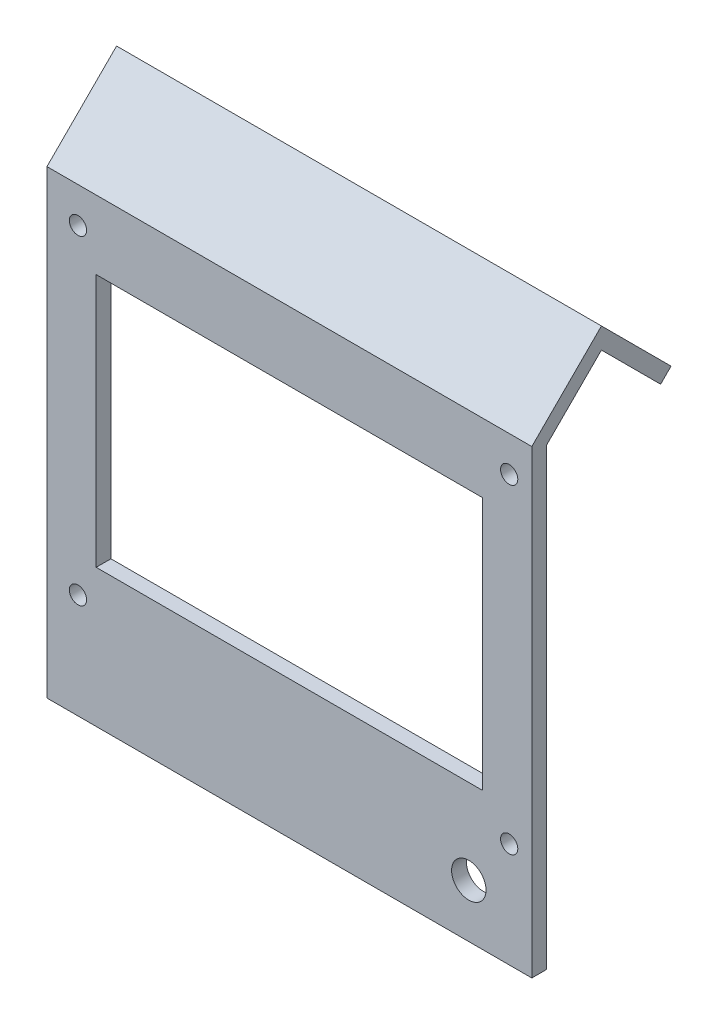
ISO-10303-21;
HEADER;
FILE_DESCRIPTION(('STEP AP214'),'2;1');
FILE_NAME('part.step','',(''),(''),'','','');
FILE_SCHEMA(('AUTOMOTIVE_DESIGN { 1 0 10303 214 1 1 1 1 }'));
ENDSEC;
DATA;
#1=APPLICATION_CONTEXT('core data for automotive mechanical design processes');
#2=APPLICATION_PROTOCOL_DEFINITION('international standard','automotive_design',2000,#1);
#3=PRODUCT_CONTEXT('',#1,'mechanical');
#4=PRODUCT('Part','Part','',(#3));
#5=PRODUCT_RELATED_PRODUCT_CATEGORY('part','',(#4));
#6=PRODUCT_DEFINITION_FORMATION('','',#4);
#7=PRODUCT_DEFINITION_CONTEXT('part definition',#1,'design');
#8=PRODUCT_DEFINITION('design','',#6,#7);
#9=PRODUCT_DEFINITION_SHAPE('','',#8);
#10=(LENGTH_UNIT() NAMED_UNIT(*) SI_UNIT(.MILLI.,.METRE.));
#11=(NAMED_UNIT(*) PLANE_ANGLE_UNIT() SI_UNIT($,.RADIAN.));
#12=(NAMED_UNIT(*) SI_UNIT($,.STERADIAN.) SOLID_ANGLE_UNIT());
#13=UNCERTAINTY_MEASURE_WITH_UNIT(LENGTH_MEASURE(1.E-05),#10,'distance_accuracy_value','');
#14=(GEOMETRIC_REPRESENTATION_CONTEXT(3) GLOBAL_UNCERTAINTY_ASSIGNED_CONTEXT((#13)) GLOBAL_UNIT_ASSIGNED_CONTEXT((#10,
#11,#12)) REPRESENTATION_CONTEXT('',''));
#15=CARTESIAN_POINT('',(0.,0.,0.));
#16=DIRECTION('',(0.,0.,1.));
#17=DIRECTION('',(1.,0.,0.));
#18=AXIS2_PLACEMENT_3D('',#15,#16,#17);
#19=CARTESIAN_POINT('',(0.,0.,3.));
#20=DIRECTION('',(0.,0.,-1.));
#21=DIRECTION('',(-1.,0.,0.));
#22=AXIS2_PLACEMENT_3D('',#19,#20,#21);
#23=PLANE('',#22);
#24=CARTESIAN_POINT('',(85.7,10.8,3.));
#25=DIRECTION('',(0.,0.,1.));
#26=DIRECTION('',(1.,0.,0.));
#27=AXIS2_PLACEMENT_3D('',#24,#25,#26);
#28=CIRCLE('',#27,3.50000000000001);
#29=CARTESIAN_POINT('',(89.2,10.8,3.));
#30=VERTEX_POINT('',#29);
#31=EDGE_CURVE('E170',#30,#30,#28,.T.);
#32=ORIENTED_EDGE('',*,*,#31,.F.);
#33=EDGE_LOOP('',(#32));
#34=FACE_BOUND('',#33,.T.);
#35=CARTESIAN_POINT('',(93.9,86.3,3.));
#36=DIRECTION('',(0.,0.,1.));
#37=DIRECTION('',(1.,0.,0.));
#38=AXIS2_PLACEMENT_3D('',#35,#36,#37);
#39=CIRCLE('',#38,1.75);
#40=CARTESIAN_POINT('',(95.65,86.3,3.));
#41=VERTEX_POINT('',#40);
#42=EDGE_CURVE('E177',#41,#41,#39,.T.);
#43=ORIENTED_EDGE('',*,*,#42,.F.);
#44=EDGE_LOOP('',(#43));
#45=FACE_BOUND('',#44,.T.);
#46=CARTESIAN_POINT('',(93.9,21.3,3.));
#47=DIRECTION('',(0.,0.,1.));
#48=DIRECTION('',(1.,0.,0.));
#49=AXIS2_PLACEMENT_3D('',#46,#47,#48);
#50=CIRCLE('',#49,1.75);
#51=CARTESIAN_POINT('',(95.65,21.3,3.));
#52=VERTEX_POINT('',#51);
#53=EDGE_CURVE('E183',#52,#52,#50,.T.);
#54=ORIENTED_EDGE('',*,*,#53,.F.);
#55=EDGE_LOOP('',(#54));
#56=FACE_BOUND('',#55,.T.);
#57=CARTESIAN_POINT('',(6.30000000000001,21.3,3.));
#58=DIRECTION('',(0.,0.,1.));
#59=DIRECTION('',(1.,0.,0.));
#60=AXIS2_PLACEMENT_3D('',#57,#58,#59);
#61=CIRCLE('',#60,1.75);
#62=CARTESIAN_POINT('',(8.05000000000002,21.3,3.));
#63=VERTEX_POINT('',#62);
#64=EDGE_CURVE('E189',#63,#63,#61,.T.);
#65=ORIENTED_EDGE('',*,*,#64,.F.);
#66=EDGE_LOOP('',(#65));
#67=FACE_BOUND('',#66,.T.);
#68=CARTESIAN_POINT('',(6.30000000000001,86.3,3.));
#69=DIRECTION('',(0.,0.,1.));
#70=DIRECTION('',(1.,0.,0.));
#71=AXIS2_PLACEMENT_3D('',#68,#69,#70);
#72=CIRCLE('',#71,1.75);
#73=CARTESIAN_POINT('',(8.05000000000002,86.3,3.));
#74=VERTEX_POINT('',#73);
#75=EDGE_CURVE('E195',#74,#74,#72,.T.);
#76=ORIENTED_EDGE('',*,*,#75,.F.);
#77=EDGE_LOOP('',(#76));
#78=FACE_BOUND('',#77,.T.);
#79=DIRECTION('',(0.,-1.,0.));
#80=VECTOR('',#79,1.);
#81=CARTESIAN_POINT('',(0.,0.,3.));
#82=LINE('',#81,#80);
#83=CARTESIAN_POINT('',(0.,93.5,3.));
#84=VERTEX_POINT('',#83);
#85=CARTESIAN_POINT('',(0.,0.,3.));
#86=VERTEX_POINT('',#85);
#87=EDGE_CURVE('E229',#84,#86,#82,.T.);
#88=ORIENTED_EDGE('',*,*,#87,.T.);
#89=DIRECTION('',(1.,0.,0.));
#90=VECTOR('',#89,1.);
#91=CARTESIAN_POINT('',(0.,0.,3.));
#92=LINE('',#91,#90);
#93=CARTESIAN_POINT('',(98.5,0.,3.));
#94=VERTEX_POINT('',#93);
#95=EDGE_CURVE('E232',#86,#94,#92,.T.);
#96=ORIENTED_EDGE('',*,*,#95,.T.);
#97=DIRECTION('',(0.,1.,0.));
#98=VECTOR('',#97,1.);
#99=CARTESIAN_POINT('',(98.5,0.,3.));
#100=LINE('',#99,#98);
#101=CARTESIAN_POINT('',(98.5,93.5,3.));
#102=VERTEX_POINT('',#101);
#103=EDGE_CURVE('E235',#94,#102,#100,.T.);
#104=ORIENTED_EDGE('',*,*,#103,.T.);
#105=DIRECTION('',(-1.,0.,0.));
#106=VECTOR('',#105,1.);
#107=CARTESIAN_POINT('',(0.,93.5,3.));
#108=LINE('',#107,#106);
#109=EDGE_CURVE('E238',#102,#84,#108,.T.);
#110=ORIENTED_EDGE('',*,*,#109,.T.);
#111=EDGE_LOOP('',(#88,#96,#104,#110));
#112=FACE_BOUND('',#111,.T.);
#113=DIRECTION('',(0.,-1.,0.));
#114=VECTOR('',#113,1.);
#115=CARTESIAN_POINT('',(10.,79.5,3.));
#116=LINE('',#115,#114);
#117=CARTESIAN_POINT('',(10.,79.5,3.));
#118=VERTEX_POINT('',#117);
#119=CARTESIAN_POINT('',(10.,28.,3.));
#120=VERTEX_POINT('',#119);
#121=EDGE_CURVE('E200',#118,#120,#116,.T.);
#122=ORIENTED_EDGE('',*,*,#121,.F.);
#123=DIRECTION('',(-1.,0.,0.));
#124=VECTOR('',#123,1.);
#125=CARTESIAN_POINT('',(10.,79.5,3.));
#126=LINE('',#125,#124);
#127=CARTESIAN_POINT('',(88.5,79.5,3.));
#128=VERTEX_POINT('',#127);
#129=EDGE_CURVE('E207',#128,#118,#126,.T.);
#130=ORIENTED_EDGE('',*,*,#129,.F.);
#131=DIRECTION('',(0.,1.,0.));
#132=VECTOR('',#131,1.);
#133=CARTESIAN_POINT('',(88.5,79.5,3.));
#134=LINE('',#133,#132);
#135=CARTESIAN_POINT('',(88.5,28.,3.));
#136=VERTEX_POINT('',#135);
#137=EDGE_CURVE('E205',#136,#128,#134,.T.);
#138=ORIENTED_EDGE('',*,*,#137,.F.);
#139=DIRECTION('',(1.,0.,0.));
#140=VECTOR('',#139,1.);
#141=CARTESIAN_POINT('',(10.,28.,3.));
#142=LINE('',#141,#140);
#143=EDGE_CURVE('E202',#120,#136,#142,.T.);
#144=ORIENTED_EDGE('',*,*,#143,.F.);
#145=EDGE_LOOP('',(#122,#130,#138,#144));
#146=FACE_BOUND('',#145,.T.);
#147=ADVANCED_FACE('F33',(#34,#45,#56,#67,#78,#112,#146),#23,.F.);
#148=CARTESIAN_POINT('',(0.,0.,0.));
#149=DIRECTION('',(0.,0.,-1.));
#150=DIRECTION('',(-1.,0.,0.));
#151=AXIS2_PLACEMENT_3D('',#148,#149,#150);
#152=PLANE('',#151);
#153=DIRECTION('',(-1.,0.,0.));
#154=VECTOR('',#153,1.);
#155=CARTESIAN_POINT('',(0.,92.2573593128807,0.));
#156=LINE('',#155,#154);
#157=CARTESIAN_POINT('',(98.5,92.2573593128807,0.));
#158=VERTEX_POINT('',#157);
#159=CARTESIAN_POINT('',(0.,92.2573593128807,0.));
#160=VERTEX_POINT('',#159);
#161=EDGE_CURVE('E166',#158,#160,#156,.T.);
#162=ORIENTED_EDGE('',*,*,#161,.F.);
#163=DIRECTION('',(0.,1.,0.));
#164=VECTOR('',#163,1.);
#165=CARTESIAN_POINT('',(98.5,0.,0.));
#166=LINE('',#165,#164);
#167=CARTESIAN_POINT('',(98.5,0.,0.));
#168=VERTEX_POINT('',#167);
#169=EDGE_CURVE('E233',#168,#158,#166,.T.);
#170=ORIENTED_EDGE('',*,*,#169,.F.);
#171=DIRECTION('',(1.,0.,0.));
#172=VECTOR('',#171,1.);
#173=CARTESIAN_POINT('',(0.,0.,0.));
#174=LINE('',#173,#172);
#175=CARTESIAN_POINT('',(0.,0.,0.));
#176=VERTEX_POINT('',#175);
#177=EDGE_CURVE('E242',#176,#168,#174,.T.);
#178=ORIENTED_EDGE('',*,*,#177,.F.);
#179=DIRECTION('',(0.,-1.,0.));
#180=VECTOR('',#179,1.);
#181=CARTESIAN_POINT('',(0.,0.,0.));
#182=LINE('',#181,#180);
#183=EDGE_CURVE('E228',#160,#176,#182,.T.);
#184=ORIENTED_EDGE('',*,*,#183,.F.);
#185=EDGE_LOOP('',(#162,#170,#178,#184));
#186=FACE_BOUND('',#185,.T.);
#187=CARTESIAN_POINT('',(85.7,10.8,0.));
#188=DIRECTION('',(0.,0.,-1.));
#189=DIRECTION('',(-1.,0.,0.));
#190=AXIS2_PLACEMENT_3D('',#187,#188,#189);
#191=CIRCLE('',#190,3.50000000000001);
#192=CARTESIAN_POINT('',(82.2,10.8,0.));
#193=VERTEX_POINT('',#192);
#194=EDGE_CURVE('E174',#193,#193,#191,.F.);
#195=ORIENTED_EDGE('',*,*,#194,.T.);
#196=EDGE_LOOP('',(#195));
#197=FACE_BOUND('',#196,.T.);
#198=CARTESIAN_POINT('',(93.9,86.3,0.));
#199=DIRECTION('',(0.,0.,-1.));
#200=DIRECTION('',(-1.,0.,0.));
#201=AXIS2_PLACEMENT_3D('',#198,#199,#200);
#202=CIRCLE('',#201,1.75);
#203=CARTESIAN_POINT('',(92.15,86.3,0.));
#204=VERTEX_POINT('',#203);
#205=EDGE_CURVE('E180',#204,#204,#202,.F.);
#206=ORIENTED_EDGE('',*,*,#205,.T.);
#207=EDGE_LOOP('',(#206));
#208=FACE_BOUND('',#207,.T.);
#209=CARTESIAN_POINT('',(93.9,21.3,0.));
#210=DIRECTION('',(0.,0.,-1.));
#211=DIRECTION('',(-1.,0.,0.));
#212=AXIS2_PLACEMENT_3D('',#209,#210,#211);
#213=CIRCLE('',#212,1.75);
#214=CARTESIAN_POINT('',(92.15,21.3,0.));
#215=VERTEX_POINT('',#214);
#216=EDGE_CURVE('E186',#215,#215,#213,.F.);
#217=ORIENTED_EDGE('',*,*,#216,.T.);
#218=EDGE_LOOP('',(#217));
#219=FACE_BOUND('',#218,.T.);
#220=CARTESIAN_POINT('',(6.30000000000001,21.3,0.));
#221=DIRECTION('',(0.,0.,-1.));
#222=DIRECTION('',(-1.,0.,0.));
#223=AXIS2_PLACEMENT_3D('',#220,#221,#222);
#224=CIRCLE('',#223,1.75);
#225=CARTESIAN_POINT('',(4.55000000000001,21.3,0.));
#226=VERTEX_POINT('',#225);
#227=EDGE_CURVE('E192',#226,#226,#224,.F.);
#228=ORIENTED_EDGE('',*,*,#227,.T.);
#229=EDGE_LOOP('',(#228));
#230=FACE_BOUND('',#229,.T.);
#231=CARTESIAN_POINT('',(6.30000000000001,86.3,0.));
#232=DIRECTION('',(0.,0.,-1.));
#233=DIRECTION('',(-1.,0.,0.));
#234=AXIS2_PLACEMENT_3D('',#231,#232,#233);
#235=CIRCLE('',#234,1.75);
#236=CARTESIAN_POINT('',(4.55000000000001,86.3,0.));
#237=VERTEX_POINT('',#236);
#238=EDGE_CURVE('E169',#237,#237,#235,.F.);
#239=ORIENTED_EDGE('',*,*,#238,.T.);
#240=EDGE_LOOP('',(#239));
#241=FACE_BOUND('',#240,.T.);
#242=DIRECTION('',(-1.,0.,0.));
#243=VECTOR('',#242,1.);
#244=CARTESIAN_POINT('',(10.,79.5,0.));
#245=LINE('',#244,#243);
#246=CARTESIAN_POINT('',(88.5,79.5,0.));
#247=VERTEX_POINT('',#246);
#248=CARTESIAN_POINT('',(10.,79.5,0.));
#249=VERTEX_POINT('',#248);
#250=EDGE_CURVE('E203',#247,#249,#245,.T.);
#251=ORIENTED_EDGE('',*,*,#250,.T.);
#252=DIRECTION('',(0.,-1.,0.));
#253=VECTOR('',#252,1.);
#254=CARTESIAN_POINT('',(10.,79.5,0.));
#255=LINE('',#254,#253);
#256=CARTESIAN_POINT('',(10.,28.,0.));
#257=VERTEX_POINT('',#256);
#258=EDGE_CURVE('E173',#249,#257,#255,.T.);
#259=ORIENTED_EDGE('',*,*,#258,.T.);
#260=DIRECTION('',(1.,0.,0.));
#261=VECTOR('',#260,1.);
#262=CARTESIAN_POINT('',(10.,28.,0.));
#263=LINE('',#262,#261);
#264=CARTESIAN_POINT('',(88.5,28.,0.));
#265=VERTEX_POINT('',#264);
#266=EDGE_CURVE('E212',#257,#265,#263,.T.);
#267=ORIENTED_EDGE('',*,*,#266,.T.);
#268=DIRECTION('',(0.,1.,0.));
#269=VECTOR('',#268,1.);
#270=CARTESIAN_POINT('',(88.5,79.5,0.));
#271=LINE('',#270,#269);
#272=EDGE_CURVE('E215',#265,#247,#271,.T.);
#273=ORIENTED_EDGE('',*,*,#272,.T.);
#274=EDGE_LOOP('',(#251,#259,#267,#273));
#275=FACE_BOUND('',#274,.T.);
#276=ADVANCED_FACE('F253',(#186,#197,#208,#219,#230,#241,#275),#152,.T.);
#277=CARTESIAN_POINT('',(0.,0.,3.));
#278=DIRECTION('',(1.,0.,0.));
#279=DIRECTION('',(0.,0.,-1.));
#280=AXIS2_PLACEMENT_3D('',#277,#278,#279);
#281=PLANE('',#280);
#282=DIRECTION('',(0.,0.707106781186551,-0.707106781186544));
#283=VECTOR('',#282,1.);
#284=CARTESIAN_POINT('',(0.,93.5,3.));
#285=LINE('',#284,#283);
#286=CARTESIAN_POINT('',(0.,107.642135623731,-11.1421356237309));
#287=VERTEX_POINT('',#286);
#288=EDGE_CURVE('E157',#84,#287,#285,.T.);
#289=ORIENTED_EDGE('',*,*,#288,.T.);
#290=DIRECTION('',(0.,-0.707106781186543,-0.707106781186553));
#291=VECTOR('',#290,1.);
#292=CARTESIAN_POINT('',(0.,105.520815280171,-13.2634559672905));
#293=LINE('',#292,#291);
#294=CARTESIAN_POINT('',(0.,93.5,-25.2842712474619));
#295=VERTEX_POINT('',#294);
#296=EDGE_CURVE('E162',#287,#295,#293,.T.);
#297=ORIENTED_EDGE('',*,*,#296,.T.);
#298=DIRECTION('',(0.,-0.707106781186547,0.707106781186548));
#299=VECTOR('',#298,1.);
#300=CARTESIAN_POINT('',(0.,93.5,-25.2842712474619));
#301=LINE('',#300,#299);
#302=CARTESIAN_POINT('',(0.,91.3786796564403,-23.1629509039023));
#303=VERTEX_POINT('',#302);
#304=EDGE_CURVE('E143',#295,#303,#301,.T.);
#305=ORIENTED_EDGE('',*,*,#304,.T.);
#306=DIRECTION('',(0.,0.707106781186548,0.707106781186547));
#307=VECTOR('',#306,1.);
#308=CARTESIAN_POINT('',(0.,91.3786796564403,-23.1629509039023));
#309=LINE('',#308,#307);
#310=CARTESIAN_POINT('',(0.,103.399494936612,-11.1421356237309));
#311=VERTEX_POINT('',#310);
#312=EDGE_CURVE('E48',#303,#311,#309,.T.);
#313=ORIENTED_EDGE('',*,*,#312,.T.);
#314=DIRECTION('',(0.,-0.707106781186551,0.707106781186544));
#315=VECTOR('',#314,1.);
#316=CARTESIAN_POINT('',(0.,91.3786796564404,0.87867965644035));
#317=LINE('',#316,#315);
#318=EDGE_CURVE('E158',#311,#160,#317,.T.);
#319=ORIENTED_EDGE('',*,*,#318,.T.);
#320=ORIENTED_EDGE('',*,*,#183,.T.);
#321=DIRECTION('',(0.,0.,-1.));
#322=VECTOR('',#321,1.);
#323=CARTESIAN_POINT('',(0.,0.,3.));
#324=LINE('',#323,#322);
#325=EDGE_CURVE('E11',#86,#176,#324,.T.);
#326=ORIENTED_EDGE('',*,*,#325,.F.);
#327=ORIENTED_EDGE('',*,*,#87,.F.);
#328=EDGE_LOOP('',(#289,#297,#305,#313,#319,#320,#326,#327));
#329=FACE_BOUND('',#328,.T.);
#330=ADVANCED_FACE('F35',(#329),#281,.F.);
#331=CARTESIAN_POINT('',(0.,0.,3.));
#332=DIRECTION('',(0.,1.,0.));
#333=DIRECTION('',(0.,0.,1.));
#334=AXIS2_PLACEMENT_3D('',#331,#332,#333);
#335=PLANE('',#334);
#336=ORIENTED_EDGE('',*,*,#177,.T.);
#337=DIRECTION('',(0.,0.,-1.));
#338=VECTOR('',#337,1.);
#339=CARTESIAN_POINT('',(98.5,0.,3.));
#340=LINE('',#339,#338);
#341=EDGE_CURVE('E41',#94,#168,#340,.T.);
#342=ORIENTED_EDGE('',*,*,#341,.F.);
#343=ORIENTED_EDGE('',*,*,#95,.F.);
#344=ORIENTED_EDGE('',*,*,#325,.T.);
#345=EDGE_LOOP('',(#336,#342,#343,#344));
#346=FACE_BOUND('',#345,.T.);
#347=ADVANCED_FACE('F268',(#346),#335,.F.);
#348=CARTESIAN_POINT('',(98.5,0.,3.));
#349=DIRECTION('',(-1.,0.,0.));
#350=DIRECTION('',(0.,0.,1.));
#351=AXIS2_PLACEMENT_3D('',#348,#349,#350);
#352=PLANE('',#351);
#353=DIRECTION('',(0.,-0.707106781186551,0.707106781186544));
#354=VECTOR('',#353,1.);
#355=CARTESIAN_POINT('',(98.5,91.3786796564404,0.87867965644035));
#356=LINE('',#355,#354);
#357=CARTESIAN_POINT('',(98.5,103.399494936612,-11.1421356237309));
#358=VERTEX_POINT('',#357);
#359=EDGE_CURVE('E135',#358,#158,#356,.T.);
#360=ORIENTED_EDGE('',*,*,#359,.F.);
#361=DIRECTION('',(0.,0.707106781186548,0.707106781186547));
#362=VECTOR('',#361,1.);
#363=CARTESIAN_POINT('',(98.5,91.3786796564403,-23.1629509039023));
#364=LINE('',#363,#362);
#365=CARTESIAN_POINT('',(98.5,91.3786796564403,-23.1629509039023));
#366=VERTEX_POINT('',#365);
#367=EDGE_CURVE('E145',#366,#358,#364,.T.);
#368=ORIENTED_EDGE('',*,*,#367,.F.);
#369=DIRECTION('',(0.,-0.707106781186547,0.707106781186548));
#370=VECTOR('',#369,1.);
#371=CARTESIAN_POINT('',(98.5,93.5,-25.2842712474619));
#372=LINE('',#371,#370);
#373=CARTESIAN_POINT('',(98.5,93.5,-25.2842712474619));
#374=VERTEX_POINT('',#373);
#375=EDGE_CURVE('E141',#374,#366,#372,.T.);
#376=ORIENTED_EDGE('',*,*,#375,.F.);
#377=DIRECTION('',(0.,-0.707106781186543,-0.707106781186553));
#378=VECTOR('',#377,1.);
#379=CARTESIAN_POINT('',(98.5,105.520815280171,-13.2634559672905));
#380=LINE('',#379,#378);
#381=CARTESIAN_POINT('',(98.5,107.642135623731,-11.1421356237309));
#382=VERTEX_POINT('',#381);
#383=EDGE_CURVE('E124',#382,#374,#380,.T.);
#384=ORIENTED_EDGE('',*,*,#383,.F.);
#385=DIRECTION('',(0.,0.707106781186551,-0.707106781186544));
#386=VECTOR('',#385,1.);
#387=CARTESIAN_POINT('',(98.5,93.5,3.));
#388=LINE('',#387,#386);
#389=EDGE_CURVE('E136',#102,#382,#388,.T.);
#390=ORIENTED_EDGE('',*,*,#389,.F.);
#391=ORIENTED_EDGE('',*,*,#103,.F.);
#392=ORIENTED_EDGE('',*,*,#341,.T.);
#393=ORIENTED_EDGE('',*,*,#169,.T.);
#394=EDGE_LOOP('',(#360,#368,#376,#384,#390,#391,#392,#393));
#395=FACE_BOUND('',#394,.T.);
#396=ADVANCED_FACE('F148',(#395),#352,.F.);
#397=CARTESIAN_POINT('',(10.,79.5,3.));
#398=DIRECTION('',(1.,0.,0.));
#399=DIRECTION('',(0.,1.,0.));
#400=AXIS2_PLACEMENT_3D('',#397,#398,#399);
#401=PLANE('',#400);
#402=ORIENTED_EDGE('',*,*,#258,.F.);
#403=DIRECTION('',(0.,0.,-1.));
#404=VECTOR('',#403,1.);
#405=CARTESIAN_POINT('',(10.,79.5,3.));
#406=LINE('',#405,#404);
#407=EDGE_CURVE('E209',#118,#249,#406,.T.);
#408=ORIENTED_EDGE('',*,*,#407,.F.);
#409=ORIENTED_EDGE('',*,*,#121,.T.);
#410=DIRECTION('',(0.,0.,-1.));
#411=VECTOR('',#410,1.);
#412=CARTESIAN_POINT('',(10.,28.,3.));
#413=LINE('',#412,#411);
#414=EDGE_CURVE('E225',#120,#257,#413,.T.);
#415=ORIENTED_EDGE('',*,*,#414,.T.);
#416=EDGE_LOOP('',(#402,#408,#409,#415));
#417=FACE_BOUND('',#416,.T.);
#418=ADVANCED_FACE('F274',(#417),#401,.T.);
#419=CARTESIAN_POINT('',(10.,28.,3.));
#420=DIRECTION('',(0.,1.,0.));
#421=DIRECTION('',(0.,0.,1.));
#422=AXIS2_PLACEMENT_3D('',#419,#420,#421);
#423=PLANE('',#422);
#424=ORIENTED_EDGE('',*,*,#266,.F.);
#425=ORIENTED_EDGE('',*,*,#414,.F.);
#426=ORIENTED_EDGE('',*,*,#143,.T.);
#427=DIRECTION('',(0.,0.,-1.));
#428=VECTOR('',#427,1.);
#429=CARTESIAN_POINT('',(88.5,28.,3.));
#430=LINE('',#429,#428);
#431=EDGE_CURVE('E223',#136,#265,#430,.T.);
#432=ORIENTED_EDGE('',*,*,#431,.T.);
#433=EDGE_LOOP('',(#424,#425,#426,#432));
#434=FACE_BOUND('',#433,.T.);
#435=ADVANCED_FACE('F288',(#434),#423,.T.);
#436=CARTESIAN_POINT('',(88.5,79.5,3.));
#437=DIRECTION('',(-1.,0.,0.));
#438=DIRECTION('',(0.,0.,1.));
#439=AXIS2_PLACEMENT_3D('',#436,#437,#438);
#440=PLANE('',#439);
#441=ORIENTED_EDGE('',*,*,#272,.F.);
#442=ORIENTED_EDGE('',*,*,#431,.F.);
#443=ORIENTED_EDGE('',*,*,#137,.T.);
#444=DIRECTION('',(0.,0.,-1.));
#445=VECTOR('',#444,1.);
#446=CARTESIAN_POINT('',(88.5,79.5,3.));
#447=LINE('',#446,#445);
#448=EDGE_CURVE('E56',#128,#247,#447,.T.);
#449=ORIENTED_EDGE('',*,*,#448,.T.);
#450=EDGE_LOOP('',(#441,#442,#443,#449));
#451=FACE_BOUND('',#450,.T.);
#452=ADVANCED_FACE('F292',(#451),#440,.T.);
#453=CARTESIAN_POINT('',(10.,79.5,3.));
#454=DIRECTION('',(0.,-1.,0.));
#455=DIRECTION('',(0.,0.,-1.));
#456=AXIS2_PLACEMENT_3D('',#453,#454,#455);
#457=PLANE('',#456);
#458=ORIENTED_EDGE('',*,*,#250,.F.);
#459=ORIENTED_EDGE('',*,*,#448,.F.);
#460=ORIENTED_EDGE('',*,*,#129,.T.);
#461=ORIENTED_EDGE('',*,*,#407,.T.);
#462=EDGE_LOOP('',(#458,#459,#460,#461));
#463=FACE_BOUND('',#462,.T.);
#464=ADVANCED_FACE('F296',(#463),#457,.T.);
#465=CARTESIAN_POINT('',(6.30000000000001,86.3,-0.00100000000000013));
#466=DIRECTION('',(0.,0.,1.));
#467=DIRECTION('',(1.,0.,0.));
#468=AXIS2_PLACEMENT_3D('',#465,#466,#467);
#469=CYLINDRICAL_SURFACE('',#468,1.75);
#470=ORIENTED_EDGE('',*,*,#238,.F.);
#471=EDGE_LOOP('',(#470));
#472=FACE_BOUND('',#471,.T.);
#473=ORIENTED_EDGE('',*,*,#75,.T.);
#474=EDGE_LOOP('',(#473));
#475=FACE_BOUND('',#474,.T.);
#476=ADVANCED_FACE('F300',(#472,#475),#469,.F.);
#477=CARTESIAN_POINT('',(6.30000000000001,21.3,-0.00100000000000013));
#478=DIRECTION('',(0.,0.,1.));
#479=DIRECTION('',(1.,0.,0.));
#480=AXIS2_PLACEMENT_3D('',#477,#478,#479);
#481=CYLINDRICAL_SURFACE('',#480,1.75);
#482=ORIENTED_EDGE('',*,*,#227,.F.);
#483=EDGE_LOOP('',(#482));
#484=FACE_BOUND('',#483,.T.);
#485=ORIENTED_EDGE('',*,*,#64,.T.);
#486=EDGE_LOOP('',(#485));
#487=FACE_BOUND('',#486,.T.);
#488=ADVANCED_FACE('F303',(#484,#487),#481,.F.);
#489=CARTESIAN_POINT('',(93.9,21.3,-0.00100000000000013));
#490=DIRECTION('',(0.,0.,1.));
#491=DIRECTION('',(1.,0.,0.));
#492=AXIS2_PLACEMENT_3D('',#489,#490,#491);
#493=CYLINDRICAL_SURFACE('',#492,1.75);
#494=ORIENTED_EDGE('',*,*,#216,.F.);
#495=EDGE_LOOP('',(#494));
#496=FACE_BOUND('',#495,.T.);
#497=ORIENTED_EDGE('',*,*,#53,.T.);
#498=EDGE_LOOP('',(#497));
#499=FACE_BOUND('',#498,.T.);
#500=ADVANCED_FACE('F307',(#496,#499),#493,.F.);
#501=CARTESIAN_POINT('',(93.9,86.3,-0.00100000000000013));
#502=DIRECTION('',(0.,0.,1.));
#503=DIRECTION('',(1.,0.,0.));
#504=AXIS2_PLACEMENT_3D('',#501,#502,#503);
#505=CYLINDRICAL_SURFACE('',#504,1.75);
#506=ORIENTED_EDGE('',*,*,#205,.F.);
#507=EDGE_LOOP('',(#506));
#508=FACE_BOUND('',#507,.T.);
#509=ORIENTED_EDGE('',*,*,#42,.T.);
#510=EDGE_LOOP('',(#509));
#511=FACE_BOUND('',#510,.T.);
#512=ADVANCED_FACE('F311',(#508,#511),#505,.F.);
#513=CARTESIAN_POINT('',(85.7,10.8,-0.00100000000000013));
#514=DIRECTION('',(0.,0.,1.));
#515=DIRECTION('',(1.,0.,0.));
#516=AXIS2_PLACEMENT_3D('',#513,#514,#515);
#517=CYLINDRICAL_SURFACE('',#516,3.50000000000001);
#518=ORIENTED_EDGE('',*,*,#194,.F.);
#519=EDGE_LOOP('',(#518));
#520=FACE_BOUND('',#519,.T.);
#521=ORIENTED_EDGE('',*,*,#31,.T.);
#522=EDGE_LOOP('',(#521));
#523=FACE_BOUND('',#522,.T.);
#524=ADVANCED_FACE('F315',(#520,#523),#517,.F.);
#525=CARTESIAN_POINT('',(98.5,91.3786796564404,0.87867965644035));
#526=DIRECTION('',(0.,-0.707106781186544,-0.707106781186551));
#527=DIRECTION('',(0.,0.707106781186551,-0.707106781186544));
#528=AXIS2_PLACEMENT_3D('',#525,#526,#527);
#529=PLANE('',#528);
#530=DIRECTION('',(-1.,0.,0.));
#531=VECTOR('',#530,1.);
#532=CARTESIAN_POINT('',(98.5,103.399494936612,-11.1421356237309));
#533=LINE('',#532,#531);
#534=EDGE_CURVE('E154',#358,#311,#533,.T.);
#535=ORIENTED_EDGE('',*,*,#534,.F.);
#536=ORIENTED_EDGE('',*,*,#359,.T.);
#537=ORIENTED_EDGE('',*,*,#161,.T.);
#538=ORIENTED_EDGE('',*,*,#318,.F.);
#539=EDGE_LOOP('',(#535,#536,#537,#538));
#540=FACE_BOUND('',#539,.T.);
#541=ADVANCED_FACE('F259',(#540),#529,.T.);
#542=CARTESIAN_POINT('',(98.5,105.520815280171,-13.2634559672905));
#543=DIRECTION('',(0.,0.707106781186553,-0.707106781186543));
#544=DIRECTION('',(0.,0.707106781186543,0.707106781186553));
#545=AXIS2_PLACEMENT_3D('',#542,#543,#544);
#546=PLANE('',#545);
#547=ORIENTED_EDGE('',*,*,#296,.F.);
#548=DIRECTION('',(-1.,0.,0.));
#549=VECTOR('',#548,1.);
#550=CARTESIAN_POINT('',(98.5,107.642135623731,-11.1421356237309));
#551=LINE('',#550,#549);
#552=EDGE_CURVE('E131',#382,#287,#551,.T.);
#553=ORIENTED_EDGE('',*,*,#552,.F.);
#554=ORIENTED_EDGE('',*,*,#383,.T.);
#555=DIRECTION('',(-1.,0.,0.));
#556=VECTOR('',#555,1.);
#557=CARTESIAN_POINT('',(98.5,93.5,-25.2842712474619));
#558=LINE('',#557,#556);
#559=EDGE_CURVE('E128',#374,#295,#558,.T.);
#560=ORIENTED_EDGE('',*,*,#559,.T.);
#561=EDGE_LOOP('',(#547,#553,#554,#560));
#562=FACE_BOUND('',#561,.T.);
#563=ADVANCED_FACE('F127',(#562),#546,.T.);
#564=CARTESIAN_POINT('',(98.5,93.5,3.));
#565=DIRECTION('',(0.,0.707106781186544,0.707106781186551));
#566=DIRECTION('',(0.,-0.707106781186551,0.707106781186544));
#567=AXIS2_PLACEMENT_3D('',#564,#565,#566);
#568=PLANE('',#567);
#569=ORIENTED_EDGE('',*,*,#389,.T.);
#570=ORIENTED_EDGE('',*,*,#552,.T.);
#571=ORIENTED_EDGE('',*,*,#288,.F.);
#572=ORIENTED_EDGE('',*,*,#109,.F.);
#573=EDGE_LOOP('',(#569,#570,#571,#572));
#574=FACE_BOUND('',#573,.T.);
#575=ADVANCED_FACE('F265',(#574),#568,.T.);
#576=CARTESIAN_POINT('',(98.5,91.3786796564403,-23.1629509039023));
#577=DIRECTION('',(0.,-0.707106781186547,0.707106781186548));
#578=DIRECTION('',(0.,-0.707106781186548,-0.707106781186547));
#579=AXIS2_PLACEMENT_3D('',#576,#577,#578);
#580=PLANE('',#579);
#581=ORIENTED_EDGE('',*,*,#367,.T.);
#582=ORIENTED_EDGE('',*,*,#534,.T.);
#583=ORIENTED_EDGE('',*,*,#312,.F.);
#584=DIRECTION('',(-1.,0.,0.));
#585=VECTOR('',#584,1.);
#586=CARTESIAN_POINT('',(98.5,91.3786796564403,-23.1629509039023));
#587=LINE('',#586,#585);
#588=EDGE_CURVE('E144',#366,#303,#587,.T.);
#589=ORIENTED_EDGE('',*,*,#588,.F.);
#590=EDGE_LOOP('',(#581,#582,#583,#589));
#591=FACE_BOUND('',#590,.T.);
#592=ADVANCED_FACE('F261',(#591),#580,.T.);
#593=CARTESIAN_POINT('',(98.5,93.5,-25.2842712474619));
#594=DIRECTION('',(0.,-0.707106781186548,-0.707106781186547));
#595=DIRECTION('',(0.,0.707106781186547,-0.707106781186548));
#596=AXIS2_PLACEMENT_3D('',#593,#594,#595);
#597=PLANE('',#596);
#598=ORIENTED_EDGE('',*,*,#304,.F.);
#599=ORIENTED_EDGE('',*,*,#559,.F.);
#600=ORIENTED_EDGE('',*,*,#375,.T.);
#601=ORIENTED_EDGE('',*,*,#588,.T.);
#602=EDGE_LOOP('',(#598,#599,#600,#601));
#603=FACE_BOUND('',#602,.T.);
#604=ADVANCED_FACE('F140',(#603),#597,.T.);
#605=CLOSED_SHELL('',(#147,#276,#330,#347,#396,#418,#435,#452,#464,#476,#488,#500,#512,#524,
#541,#563,#575,#592,#604));
#606=MANIFOLD_SOLID_BREP('B2',#605);
#607=ADVANCED_BREP_SHAPE_REPRESENTATION('',(#18,#606),#14);
#608=SHAPE_DEFINITION_REPRESENTATION(#9,#607);
ENDSEC;
END-ISO-10303-21;
